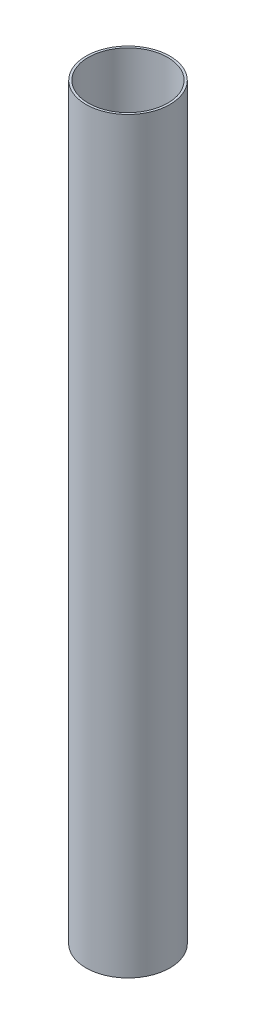
ISO-10303-21;
HEADER;
FILE_DESCRIPTION(('STEP AP214'),'2;1');
FILE_NAME('part.step','',(''),(''),'','','');
FILE_SCHEMA(('AUTOMOTIVE_DESIGN { 1 0 10303 214 1 1 1 1 }'));
ENDSEC;
DATA;
#1=APPLICATION_CONTEXT('core data for automotive mechanical design processes');
#2=APPLICATION_PROTOCOL_DEFINITION('international standard','automotive_design',2000,#1);
#3=PRODUCT_CONTEXT('',#1,'mechanical');
#4=PRODUCT('Part','Part','',(#3));
#5=PRODUCT_RELATED_PRODUCT_CATEGORY('part','',(#4));
#6=PRODUCT_DEFINITION_FORMATION('','',#4);
#7=PRODUCT_DEFINITION_CONTEXT('part definition',#1,'design');
#8=PRODUCT_DEFINITION('design','',#6,#7);
#9=PRODUCT_DEFINITION_SHAPE('','',#8);
#10=(LENGTH_UNIT() NAMED_UNIT(*) SI_UNIT(.MILLI.,.METRE.));
#11=(NAMED_UNIT(*) PLANE_ANGLE_UNIT() SI_UNIT($,.RADIAN.));
#12=(NAMED_UNIT(*) SI_UNIT($,.STERADIAN.) SOLID_ANGLE_UNIT());
#13=UNCERTAINTY_MEASURE_WITH_UNIT(LENGTH_MEASURE(1.E-05),#10,'distance_accuracy_value','');
#14=(GEOMETRIC_REPRESENTATION_CONTEXT(3) GLOBAL_UNCERTAINTY_ASSIGNED_CONTEXT((#13)) GLOBAL_UNIT_ASSIGNED_CONTEXT((#10,
#11,#12)) REPRESENTATION_CONTEXT('',''));
#15=CARTESIAN_POINT('',(0.,0.,0.));
#16=DIRECTION('',(0.,0.,1.));
#17=DIRECTION('',(1.,0.,0.));
#18=AXIS2_PLACEMENT_3D('',#15,#16,#17);
#19=CARTESIAN_POINT('',(0.,123.620053705202,0.));
#20=DIRECTION('',(0.,1.,0.));
#21=DIRECTION('',(0.,0.,1.));
#22=AXIS2_PLACEMENT_3D('',#19,#20,#21);
#23=CYLINDRICAL_SURFACE('',#22,28.4988);
#24=CARTESIAN_POINT('',(0.,508.,0.));
#25=DIRECTION('',(0.,1.,0.));
#26=DIRECTION('',(0.,0.,1.));
#27=AXIS2_PLACEMENT_3D('',#24,#25,#26);
#28=CIRCLE('',#27,28.4988);
#29=CARTESIAN_POINT('',(0.,508.,28.4988));
#30=VERTEX_POINT('',#29);
#31=EDGE_CURVE('E10',#30,#30,#28,.T.);
#32=ORIENTED_EDGE('',*,*,#31,.F.);
#33=EDGE_LOOP('',(#32));
#34=FACE_BOUND('',#33,.T.);
#35=CARTESIAN_POINT('',(0.,0.,0.));
#36=DIRECTION('',(0.,1.,0.));
#37=DIRECTION('',(0.,0.,1.));
#38=AXIS2_PLACEMENT_3D('',#35,#36,#37);
#39=CIRCLE('',#38,28.4988);
#40=CARTESIAN_POINT('',(0.,0.,28.4988));
#41=VERTEX_POINT('',#40);
#42=EDGE_CURVE('E48',#41,#41,#39,.T.);
#43=ORIENTED_EDGE('',*,*,#42,.T.);
#44=EDGE_LOOP('',(#43));
#45=FACE_BOUND('',#44,.T.);
#46=ADVANCED_FACE('F34',(#34,#45),#23,.T.);
#47=CARTESIAN_POINT('',(28.4988,508.,0.));
#48=DIRECTION('',(0.,-1.,0.));
#49=DIRECTION('',(0.,0.,-1.));
#50=AXIS2_PLACEMENT_3D('',#47,#48,#49);
#51=PLANE('',#50);
#52=CARTESIAN_POINT('',(0.,508.,0.));
#53=DIRECTION('',(0.,1.,0.));
#54=DIRECTION('',(0.,0.,1.));
#55=AXIS2_PLACEMENT_3D('',#52,#53,#54);
#56=CIRCLE('',#55,26.9748);
#57=CARTESIAN_POINT('',(0.,508.,26.9748));
#58=VERTEX_POINT('',#57);
#59=EDGE_CURVE('E40',#58,#58,#56,.T.);
#60=ORIENTED_EDGE('',*,*,#59,.F.);
#61=EDGE_LOOP('',(#60));
#62=FACE_BOUND('',#61,.T.);
#63=ORIENTED_EDGE('',*,*,#31,.T.);
#64=EDGE_LOOP('',(#63));
#65=FACE_BOUND('',#64,.T.);
#66=ADVANCED_FACE('F63',(#62,#65),#51,.F.);
#67=CARTESIAN_POINT('',(0.,123.620053705202,0.));
#68=DIRECTION('',(0.,1.,0.));
#69=DIRECTION('',(0.,0.,1.));
#70=AXIS2_PLACEMENT_3D('',#67,#68,#69);
#71=CYLINDRICAL_SURFACE('',#70,26.9748);
#72=CARTESIAN_POINT('',(0.,0.,0.));
#73=DIRECTION('',(0.,1.,0.));
#74=DIRECTION('',(0.,0.,1.));
#75=AXIS2_PLACEMENT_3D('',#72,#73,#74);
#76=CIRCLE('',#75,26.9748);
#77=CARTESIAN_POINT('',(0.,0.,26.9748));
#78=VERTEX_POINT('',#77);
#79=EDGE_CURVE('E44',#78,#78,#76,.T.);
#80=ORIENTED_EDGE('',*,*,#79,.F.);
#81=EDGE_LOOP('',(#80));
#82=FACE_BOUND('',#81,.T.);
#83=ORIENTED_EDGE('',*,*,#59,.T.);
#84=EDGE_LOOP('',(#83));
#85=FACE_BOUND('',#84,.T.);
#86=ADVANCED_FACE('F58',(#82,#85),#71,.F.);
#87=CARTESIAN_POINT('',(26.9748,0.,0.));
#88=DIRECTION('',(0.,1.,0.));
#89=DIRECTION('',(0.,0.,1.));
#90=AXIS2_PLACEMENT_3D('',#87,#88,#89);
#91=PLANE('',#90);
#92=ORIENTED_EDGE('',*,*,#42,.F.);
#93=EDGE_LOOP('',(#92));
#94=FACE_BOUND('',#93,.T.);
#95=ORIENTED_EDGE('',*,*,#79,.T.);
#96=EDGE_LOOP('',(#95));
#97=FACE_BOUND('',#96,.T.);
#98=ADVANCED_FACE('F55',(#94,#97),#91,.F.);
#99=CLOSED_SHELL('',(#46,#66,#86,#98));
#100=MANIFOLD_SOLID_BREP('B2',#99);
#101=ADVANCED_BREP_SHAPE_REPRESENTATION('',(#18,#100),#14);
#102=SHAPE_DEFINITION_REPRESENTATION(#9,#101);
ENDSEC;
END-ISO-10303-21;
